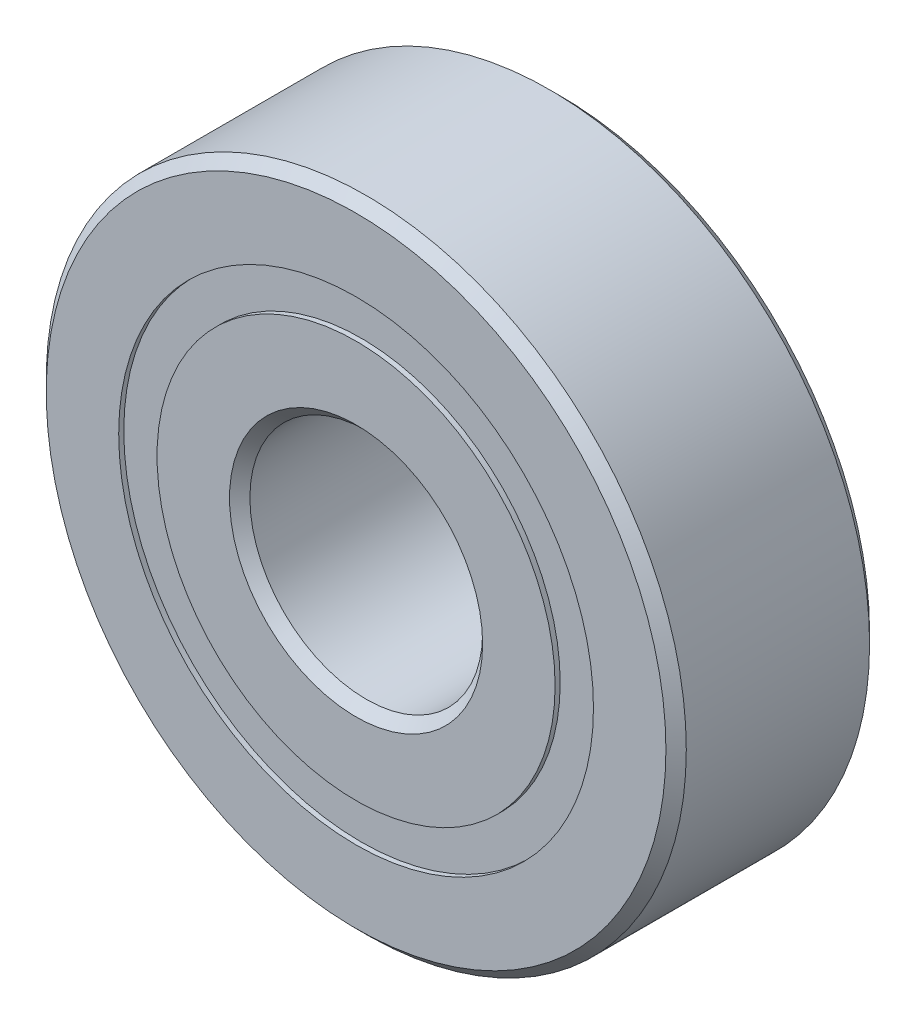
ISO-10303-21;
HEADER;
FILE_DESCRIPTION(('STEP AP214'),'2;1');
FILE_NAME('part.step','',(''),(''),'','','');
FILE_SCHEMA(('AUTOMOTIVE_DESIGN { 1 0 10303 214 1 1 1 1 }'));
ENDSEC;
DATA;
#1=APPLICATION_CONTEXT('core data for automotive mechanical design processes');
#2=APPLICATION_PROTOCOL_DEFINITION('international standard','automotive_design',2000,#1);
#3=PRODUCT_CONTEXT('',#1,'mechanical');
#4=PRODUCT('Part','Part','',(#3));
#5=PRODUCT_RELATED_PRODUCT_CATEGORY('part','',(#4));
#6=PRODUCT_DEFINITION_FORMATION('','',#4);
#7=PRODUCT_DEFINITION_CONTEXT('part definition',#1,'design');
#8=PRODUCT_DEFINITION('design','',#6,#7);
#9=PRODUCT_DEFINITION_SHAPE('','',#8);
#10=(LENGTH_UNIT() NAMED_UNIT(*) SI_UNIT(.MILLI.,.METRE.));
#11=(NAMED_UNIT(*) PLANE_ANGLE_UNIT() SI_UNIT($,.RADIAN.));
#12=(NAMED_UNIT(*) SI_UNIT($,.STERADIAN.) SOLID_ANGLE_UNIT());
#13=UNCERTAINTY_MEASURE_WITH_UNIT(LENGTH_MEASURE(1.E-05),#10,'distance_accuracy_value','');
#14=(GEOMETRIC_REPRESENTATION_CONTEXT(3) GLOBAL_UNCERTAINTY_ASSIGNED_CONTEXT((#13)) GLOBAL_UNIT_ASSIGNED_CONTEXT((#10,
#11,#12)) REPRESENTATION_CONTEXT('',''));
#15=CARTESIAN_POINT('',(0.,0.,0.));
#16=DIRECTION('',(0.,0.,1.));
#17=DIRECTION('',(1.,0.,0.));
#18=AXIS2_PLACEMENT_3D('',#15,#16,#17);
#19=CARTESIAN_POINT('',(-3.74999999999992,6.49519052838334,0.));
#20=DIRECTION('',(0.,0.,1.));
#21=DIRECTION('',(-0.499999999999989,0.866025403784445,0.));
#22=AXIS2_PLACEMENT_3D('',#19,#20,#21);
#23=SPHERICAL_SURFACE('',#22,1.68952158656808);
#24=CARTESIAN_POINT('',(-3.74999999999992,6.49519052838334,1.68952158656808));
#25=VERTEX_POINT('',#24);
#26=VERTEX_LOOP('',#25);
#27=FACE_BOUND('',#26,.T.);
#28=ADVANCED_FACE('F42',(#27),#23,.T.);
#29=CLOSED_SHELL('',(#28));
#30=MANIFOLD_SOLID_BREP('B2',#29);
#31=CARTESIAN_POINT('',(-6.49519052838325,3.75000000000008,0.));
#32=DIRECTION('',(0.,0.,1.));
#33=DIRECTION('',(-0.866025403784433,0.50000000000001,0.));
#34=AXIS2_PLACEMENT_3D('',#31,#32,#33);
#35=SPHERICAL_SURFACE('',#34,1.68952158656808);
#36=CARTESIAN_POINT('',(-6.49519052838325,3.75000000000008,1.68952158656808));
#37=VERTEX_POINT('',#36);
#38=VERTEX_LOOP('',#37);
#39=FACE_BOUND('',#38,.T.);
#40=ADVANCED_FACE('F65',(#39),#35,.T.);
#41=CLOSED_SHELL('',(#40));
#42=MANIFOLD_SOLID_BREP('B6',#41);
#43=CARTESIAN_POINT('',(-7.50000000000001,0.,0.));
#44=DIRECTION('',(0.,0.,1.));
#45=DIRECTION('',(-1.,0.,0.));
#46=AXIS2_PLACEMENT_3D('',#43,#44,#45);
#47=SPHERICAL_SURFACE('',#46,1.68952158656808);
#48=CARTESIAN_POINT('',(-7.50000000000001,0.,1.68952158656808));
#49=VERTEX_POINT('',#48);
#50=VERTEX_LOOP('',#49);
#51=FACE_BOUND('',#50,.T.);
#52=ADVANCED_FACE('F88',(#51),#47,.T.);
#53=CLOSED_SHELL('',(#52));
#54=MANIFOLD_SOLID_BREP('B38',#53);
#55=CARTESIAN_POINT('',(-6.49519052838333,-3.74999999999994,0.));
#56=DIRECTION('',(0.,0.,1.));
#57=DIRECTION('',(-0.866025403784443,-0.499999999999992,0.));
#58=AXIS2_PLACEMENT_3D('',#55,#56,#57);
#59=SPHERICAL_SURFACE('',#58,1.68952158656808);
#60=CARTESIAN_POINT('',(-6.49519052838333,-3.74999999999994,1.68952158656808));
#61=VERTEX_POINT('',#60);
#62=VERTEX_LOOP('',#61);
#63=FACE_BOUND('',#62,.T.);
#64=ADVANCED_FACE('F111',(#63),#59,.T.);
#65=CLOSED_SHELL('',(#64));
#66=MANIFOLD_SOLID_BREP('B61',#65);
#67=CARTESIAN_POINT('',(-3.75000000000006,-6.49519052838327,0.));
#68=DIRECTION('',(0.,0.,1.));
#69=DIRECTION('',(-0.500000000000007,-0.866025403784435,0.));
#70=AXIS2_PLACEMENT_3D('',#67,#68,#69);
#71=SPHERICAL_SURFACE('',#70,1.68952158656808);
#72=CARTESIAN_POINT('',(-3.75000000000006,-6.49519052838327,1.68952158656808));
#73=VERTEX_POINT('',#72);
#74=VERTEX_LOOP('',#73);
#75=FACE_BOUND('',#74,.T.);
#76=ADVANCED_FACE('F134',(#75),#71,.T.);
#77=CLOSED_SHELL('',(#76));
#78=MANIFOLD_SOLID_BREP('B84',#77);
#79=CARTESIAN_POINT('',(0.,-7.50000000000001,0.));
#80=DIRECTION('',(0.,0.,1.));
#81=DIRECTION('',(0.,-1.,0.));
#82=AXIS2_PLACEMENT_3D('',#79,#80,#81);
#83=SPHERICAL_SURFACE('',#82,1.68952158656808);
#84=CARTESIAN_POINT('',(0.,-7.50000000000001,1.68952158656808));
#85=VERTEX_POINT('',#84);
#86=VERTEX_LOOP('',#85);
#87=FACE_BOUND('',#86,.T.);
#88=ADVANCED_FACE('F157',(#87),#83,.T.);
#89=CLOSED_SHELL('',(#88));
#90=MANIFOLD_SOLID_BREP('B107',#89);
#91=CARTESIAN_POINT('',(3.74999999999997,-6.49519052838332,0.));
#92=DIRECTION('',(0.,0.,1.));
#93=DIRECTION('',(0.499999999999995,-0.866025403784442,0.));
#94=AXIS2_PLACEMENT_3D('',#91,#92,#93);
#95=SPHERICAL_SURFACE('',#94,1.68952158656808);
#96=CARTESIAN_POINT('',(3.74999999999997,-6.49519052838332,1.68952158656808));
#97=VERTEX_POINT('',#96);
#98=VERTEX_LOOP('',#97);
#99=FACE_BOUND('',#98,.T.);
#100=ADVANCED_FACE('F180',(#99),#95,.T.);
#101=CLOSED_SHELL('',(#100));
#102=MANIFOLD_SOLID_BREP('B130',#101);
#103=CARTESIAN_POINT('',(6.49519052838328,-3.75000000000003,0.));
#104=DIRECTION('',(0.,0.,1.));
#105=DIRECTION('',(0.866025403784436,-0.500000000000004,0.));
#106=AXIS2_PLACEMENT_3D('',#103,#104,#105);
#107=SPHERICAL_SURFACE('',#106,1.68952158656808);
#108=CARTESIAN_POINT('',(6.49519052838328,-3.75000000000003,1.68952158656808));
#109=VERTEX_POINT('',#108);
#110=VERTEX_LOOP('',#109);
#111=FACE_BOUND('',#110,.T.);
#112=ADVANCED_FACE('F203',(#111),#107,.T.);
#113=CLOSED_SHELL('',(#112));
#114=MANIFOLD_SOLID_BREP('B153',#113);
#115=CARTESIAN_POINT('',(7.50000000000001,0.,0.));
#116=DIRECTION('',(0.,0.,1.));
#117=DIRECTION('',(1.,0.,0.));
#118=AXIS2_PLACEMENT_3D('',#115,#116,#117);
#119=SPHERICAL_SURFACE('',#118,1.68952158656808);
#120=CARTESIAN_POINT('',(7.50000000000001,0.,1.68952158656808));
#121=VERTEX_POINT('',#120);
#122=VERTEX_LOOP('',#121);
#123=FACE_BOUND('',#122,.T.);
#124=ADVANCED_FACE('F226',(#123),#119,.T.);
#125=CLOSED_SHELL('',(#124));
#126=MANIFOLD_SOLID_BREP('B176',#125);
#127=CARTESIAN_POINT('',(6.4951905283833,3.74999999999999,0.));
#128=DIRECTION('',(0.,0.,1.));
#129=DIRECTION('',(0.86602540378444,0.499999999999998,0.));
#130=AXIS2_PLACEMENT_3D('',#127,#128,#129);
#131=SPHERICAL_SURFACE('',#130,1.68952158656808);
#132=CARTESIAN_POINT('',(6.4951905283833,3.74999999999999,1.68952158656808));
#133=VERTEX_POINT('',#132);
#134=VERTEX_LOOP('',#133);
#135=FACE_BOUND('',#134,.T.);
#136=ADVANCED_FACE('F249',(#135),#131,.T.);
#137=CLOSED_SHELL('',(#136));
#138=MANIFOLD_SOLID_BREP('B199',#137);
#139=CARTESIAN_POINT('',(3.75000000000001,6.49519052838329,0.));
#140=DIRECTION('',(0.,0.,1.));
#141=DIRECTION('',(0.500000000000001,0.866025403784438,0.));
#142=AXIS2_PLACEMENT_3D('',#139,#140,#141);
#143=SPHERICAL_SURFACE('',#142,1.68952158656808);
#144=CARTESIAN_POINT('',(3.75000000000001,6.49519052838329,1.68952158656808));
#145=VERTEX_POINT('',#144);
#146=VERTEX_LOOP('',#145);
#147=FACE_BOUND('',#146,.T.);
#148=ADVANCED_FACE('F272',(#147),#143,.T.);
#149=CLOSED_SHELL('',(#148));
#150=MANIFOLD_SOLID_BREP('B222',#149);
#151=CARTESIAN_POINT('',(0.,7.50000000000001,0.));
#152=DIRECTION('',(0.,0.,1.));
#153=DIRECTION('',(0.,1.,0.));
#154=AXIS2_PLACEMENT_3D('',#151,#152,#153);
#155=SPHERICAL_SURFACE('',#154,1.68952158656808);
#156=CARTESIAN_POINT('',(0.,7.50000000000001,1.68952158656808));
#157=VERTEX_POINT('',#156);
#158=VERTEX_LOOP('',#157);
#159=FACE_BOUND('',#158,.T.);
#160=ADVANCED_FACE('F296',(#159),#155,.T.);
#161=CLOSED_SHELL('',(#160));
#162=MANIFOLD_SOLID_BREP('B245',#161);
#163=CARTESIAN_POINT('',(0.,0.,3.5));
#164=DIRECTION('',(0.,0.,1.));
#165=DIRECTION('',(1.,0.,0.));
#166=AXIS2_PLACEMENT_3D('',#163,#164,#165);
#167=CYLINDRICAL_SURFACE('',#166,8.15934065934067);
#168=CARTESIAN_POINT('',(0.,0.,-3.5));
#169=DIRECTION('',(0.,0.,1.));
#170=DIRECTION('',(1.,0.,0.));
#171=AXIS2_PLACEMENT_3D('',#168,#169,#170);
#172=CIRCLE('',#171,8.15934065934067);
#173=CARTESIAN_POINT('',(8.15934065934067,0.,-3.5));
#174=VERTEX_POINT('',#173);
#175=EDGE_CURVE('E351',#174,#174,#172,.T.);
#176=ORIENTED_EDGE('',*,*,#175,.F.);
#177=EDGE_LOOP('',(#176));
#178=FACE_BOUND('',#177,.T.);
#179=CARTESIAN_POINT('',(0.,0.,-3.325));
#180=DIRECTION('',(0.,0.,1.));
#181=DIRECTION('',(1.,0.,0.));
#182=AXIS2_PLACEMENT_3D('',#179,#180,#181);
#183=CIRCLE('',#182,8.15934065934067);
#184=CARTESIAN_POINT('',(8.15934065934067,0.,-3.325));
#185=VERTEX_POINT('',#184);
#186=EDGE_CURVE('E295',#185,#185,#183,.F.);
#187=ORIENTED_EDGE('',*,*,#186,.F.);
#188=EDGE_LOOP('',(#187));
#189=FACE_BOUND('',#188,.T.);
#190=ADVANCED_FACE('F312',(#178,#189),#167,.F.);
#191=CARTESIAN_POINT('',(0.,0.,3.5));
#192=DIRECTION('',(0.,0.,1.));
#193=DIRECTION('',(1.,0.,0.));
#194=AXIS2_PLACEMENT_3D('',#191,#192,#193);
#195=CYLINDRICAL_SURFACE('',#194,6.84065934065935);
#196=CARTESIAN_POINT('',(0.,0.,-3.5));
#197=DIRECTION('',(0.,0.,1.));
#198=DIRECTION('',(1.,0.,0.));
#199=AXIS2_PLACEMENT_3D('',#196,#197,#198);
#200=CIRCLE('',#199,6.84065934065935);
#201=CARTESIAN_POINT('',(6.84065934065935,0.,-3.5));
#202=VERTEX_POINT('',#201);
#203=EDGE_CURVE('E378',#202,#202,#200,.T.);
#204=ORIENTED_EDGE('',*,*,#203,.T.);
#205=EDGE_LOOP('',(#204));
#206=FACE_BOUND('',#205,.T.);
#207=CARTESIAN_POINT('',(0.,0.,-3.325));
#208=DIRECTION('',(0.,0.,1.));
#209=DIRECTION('',(1.,0.,0.));
#210=AXIS2_PLACEMENT_3D('',#207,#208,#209);
#211=CIRCLE('',#210,6.84065934065935);
#212=CARTESIAN_POINT('',(6.84065934065935,0.,-3.325));
#213=VERTEX_POINT('',#212);
#214=EDGE_CURVE('E324',#213,#213,#211,.T.);
#215=ORIENTED_EDGE('',*,*,#214,.F.);
#216=EDGE_LOOP('',(#215));
#217=FACE_BOUND('',#216,.T.);
#218=ADVANCED_FACE('F420',(#206,#217),#195,.T.);
#219=CARTESIAN_POINT('',(0.,0.,3.5));
#220=DIRECTION('',(0.,0.,1.));
#221=DIRECTION('',(1.,0.,0.));
#222=AXIS2_PLACEMENT_3D('',#219,#220,#221);
#223=CYLINDRICAL_SURFACE('',#222,8.15934065934067);
#224=CARTESIAN_POINT('',(0.,0.,3.5));
#225=DIRECTION('',(0.,0.,1.));
#226=DIRECTION('',(1.,0.,0.));
#227=AXIS2_PLACEMENT_3D('',#224,#225,#226);
#228=CIRCLE('',#227,8.15934065934067);
#229=CARTESIAN_POINT('',(8.15934065934067,0.,3.5));
#230=VERTEX_POINT('',#229);
#231=EDGE_CURVE('E342',#230,#230,#228,.T.);
#232=ORIENTED_EDGE('',*,*,#231,.T.);
#233=EDGE_LOOP('',(#232));
#234=FACE_BOUND('',#233,.T.);
#235=CARTESIAN_POINT('',(0.,0.,3.325));
#236=DIRECTION('',(0.,0.,-1.));
#237=DIRECTION('',(-1.,0.,0.));
#238=AXIS2_PLACEMENT_3D('',#235,#236,#237);
#239=CIRCLE('',#238,8.15934065934067);
#240=CARTESIAN_POINT('',(-8.15934065934067,0.,3.325));
#241=VERTEX_POINT('',#240);
#242=EDGE_CURVE('E333',#241,#241,#239,.F.);
#243=ORIENTED_EDGE('',*,*,#242,.F.);
#244=EDGE_LOOP('',(#243));
#245=FACE_BOUND('',#244,.T.);
#246=ADVANCED_FACE('F418',(#234,#245),#223,.F.);
#247=CARTESIAN_POINT('',(0.,0.,3.15));
#248=DIRECTION('',(0.,0.,-1.));
#249=DIRECTION('',(-1.,0.,0.));
#250=AXIS2_PLACEMENT_3D('',#247,#248,#249);
#251=CONICAL_SURFACE('',#250,11.,0.78539816339745);
#252=CARTESIAN_POINT('',(0.,0.,3.5));
#253=DIRECTION('',(0.,0.,1.));
#254=DIRECTION('',(1.,0.,0.));
#255=AXIS2_PLACEMENT_3D('',#252,#253,#254);
#256=CIRCLE('',#255,10.65);
#257=CARTESIAN_POINT('',(10.65,0.,3.5));
#258=VERTEX_POINT('',#257);
#259=EDGE_CURVE('E339',#258,#258,#256,.T.);
#260=ORIENTED_EDGE('',*,*,#259,.F.);
#261=EDGE_LOOP('',(#260));
#262=FACE_BOUND('',#261,.T.);
#263=CARTESIAN_POINT('',(0.,0.,3.15));
#264=DIRECTION('',(0.,0.,1.));
#265=DIRECTION('',(1.,0.,0.));
#266=AXIS2_PLACEMENT_3D('',#263,#264,#265);
#267=CIRCLE('',#266,11.);
#268=CARTESIAN_POINT('',(11.,0.,3.15));
#269=VERTEX_POINT('',#268);
#270=EDGE_CURVE('E360',#269,#269,#267,.T.);
#271=ORIENTED_EDGE('',*,*,#270,.T.);
#272=EDGE_LOOP('',(#271));
#273=FACE_BOUND('',#272,.T.);
#274=ADVANCED_FACE('F314',(#262,#273),#251,.T.);
#275=CARTESIAN_POINT('',(0.,10.65,3.5));
#276=DIRECTION('',(0.,0.,-1.));
#277=DIRECTION('',(-1.,0.,0.));
#278=AXIS2_PLACEMENT_3D('',#275,#276,#277);
#279=PLANE('',#278);
#280=ORIENTED_EDGE('',*,*,#231,.F.);
#281=EDGE_LOOP('',(#280));
#282=FACE_BOUND('',#281,.T.);
#283=ORIENTED_EDGE('',*,*,#259,.T.);
#284=EDGE_LOOP('',(#283));
#285=FACE_BOUND('',#284,.T.);
#286=ADVANCED_FACE('F428',(#282,#285),#279,.F.);
#287=CARTESIAN_POINT('',(0.,10.65,-3.5));
#288=DIRECTION('',(0.,0.,1.));
#289=DIRECTION('',(1.,0.,0.));
#290=AXIS2_PLACEMENT_3D('',#287,#288,#289);
#291=PLANE('',#290);
#292=CARTESIAN_POINT('',(0.,0.,-3.5));
#293=DIRECTION('',(0.,0.,1.));
#294=DIRECTION('',(1.,0.,0.));
#295=AXIS2_PLACEMENT_3D('',#292,#293,#294);
#296=CIRCLE('',#295,10.65);
#297=CARTESIAN_POINT('',(10.65,0.,-3.5));
#298=VERTEX_POINT('',#297);
#299=EDGE_CURVE('E354',#298,#298,#296,.T.);
#300=ORIENTED_EDGE('',*,*,#299,.F.);
#301=EDGE_LOOP('',(#300));
#302=FACE_BOUND('',#301,.T.);
#303=ORIENTED_EDGE('',*,*,#175,.T.);
#304=EDGE_LOOP('',(#303));
#305=FACE_BOUND('',#304,.T.);
#306=ADVANCED_FACE('F490',(#302,#305),#291,.F.);
#307=CARTESIAN_POINT('',(0.,0.,-3.5));
#308=DIRECTION('',(0.,0.,1.));
#309=DIRECTION('',(1.,0.,0.));
#310=AXIS2_PLACEMENT_3D('',#307,#308,#309);
#311=CONICAL_SURFACE('',#310,10.65,0.785398163397459);
#312=CARTESIAN_POINT('',(0.,0.,-3.15));
#313=DIRECTION('',(0.,0.,1.));
#314=DIRECTION('',(1.,0.,0.));
#315=AXIS2_PLACEMENT_3D('',#312,#313,#314);
#316=CIRCLE('',#315,11.);
#317=CARTESIAN_POINT('',(11.,0.,-3.15));
#318=VERTEX_POINT('',#317);
#319=EDGE_CURVE('E357',#318,#318,#316,.T.);
#320=ORIENTED_EDGE('',*,*,#319,.F.);
#321=EDGE_LOOP('',(#320));
#322=FACE_BOUND('',#321,.T.);
#323=ORIENTED_EDGE('',*,*,#299,.T.);
#324=EDGE_LOOP('',(#323));
#325=FACE_BOUND('',#324,.T.);
#326=ADVANCED_FACE('F487',(#322,#325),#311,.T.);
#327=CARTESIAN_POINT('',(0.,0.,3.5));
#328=DIRECTION('',(0.,0.,1.));
#329=DIRECTION('',(1.,0.,0.));
#330=AXIS2_PLACEMENT_3D('',#327,#328,#329);
#331=CYLINDRICAL_SURFACE('',#330,11.);
#332=ORIENTED_EDGE('',*,*,#270,.F.);
#333=EDGE_LOOP('',(#332));
#334=FACE_BOUND('',#333,.T.);
#335=ORIENTED_EDGE('',*,*,#319,.T.);
#336=EDGE_LOOP('',(#335));
#337=FACE_BOUND('',#336,.T.);
#338=ADVANCED_FACE('F414',(#334,#337),#331,.T.);
#339=CARTESIAN_POINT('',(0.,8.15934065934067,3.325));
#340=DIRECTION('',(0.,0.,-1.));
#341=DIRECTION('',(-1.,0.,0.));
#342=AXIS2_PLACEMENT_3D('',#339,#340,#341);
#343=PLANE('',#342);
#344=CARTESIAN_POINT('',(0.,0.,3.325));
#345=DIRECTION('',(0.,0.,1.));
#346=DIRECTION('',(1.,0.,0.));
#347=AXIS2_PLACEMENT_3D('',#344,#345,#346);
#348=CIRCLE('',#347,6.84065934065935);
#349=CARTESIAN_POINT('',(6.84065934065935,0.,3.325));
#350=VERTEX_POINT('',#349);
#351=EDGE_CURVE('E363',#350,#350,#348,.T.);
#352=ORIENTED_EDGE('',*,*,#351,.F.);
#353=EDGE_LOOP('',(#352));
#354=FACE_BOUND('',#353,.T.);
#355=ORIENTED_EDGE('',*,*,#242,.T.);
#356=EDGE_LOOP('',(#355));
#357=FACE_BOUND('',#356,.T.);
#358=ADVANCED_FACE('F407',(#354,#357),#343,.F.);
#359=CARTESIAN_POINT('',(0.,0.,3.5));
#360=DIRECTION('',(0.,0.,1.));
#361=DIRECTION('',(1.,0.,0.));
#362=AXIS2_PLACEMENT_3D('',#359,#360,#361);
#363=CYLINDRICAL_SURFACE('',#362,6.84065934065935);
#364=CARTESIAN_POINT('',(0.,0.,3.5));
#365=DIRECTION('',(0.,0.,1.));
#366=DIRECTION('',(1.,0.,0.));
#367=AXIS2_PLACEMENT_3D('',#364,#365,#366);
#368=CIRCLE('',#367,6.84065934065935);
#369=CARTESIAN_POINT('',(6.84065934065935,0.,3.5));
#370=VERTEX_POINT('',#369);
#371=EDGE_CURVE('E387',#370,#370,#368,.T.);
#372=ORIENTED_EDGE('',*,*,#371,.F.);
#373=EDGE_LOOP('',(#372));
#374=FACE_BOUND('',#373,.T.);
#375=ORIENTED_EDGE('',*,*,#351,.T.);
#376=EDGE_LOOP('',(#375));
#377=FACE_BOUND('',#376,.T.);
#378=ADVANCED_FACE('F404',(#374,#377),#363,.T.);
#379=CARTESIAN_POINT('',(0.,0.,3.5));
#380=DIRECTION('',(0.,0.,1.));
#381=DIRECTION('',(1.,0.,0.));
#382=AXIS2_PLACEMENT_3D('',#379,#380,#381);
#383=CONICAL_SURFACE('',#382,4.35000000000002,0.785398163397462);
#384=CARTESIAN_POINT('',(0.,0.,3.15));
#385=DIRECTION('',(0.,0.,1.));
#386=DIRECTION('',(1.,0.,0.));
#387=AXIS2_PLACEMENT_3D('',#384,#385,#386);
#388=CIRCLE('',#387,4.00000000000001);
#389=CARTESIAN_POINT('',(4.00000000000001,0.,3.15));
#390=VERTEX_POINT('',#389);
#391=EDGE_CURVE('E369',#390,#390,#388,.T.);
#392=ORIENTED_EDGE('',*,*,#391,.F.);
#393=EDGE_LOOP('',(#392));
#394=FACE_BOUND('',#393,.T.);
#395=CARTESIAN_POINT('',(0.,0.,3.5));
#396=DIRECTION('',(0.,0.,1.));
#397=DIRECTION('',(1.,0.,0.));
#398=AXIS2_PLACEMENT_3D('',#395,#396,#397);
#399=CIRCLE('',#398,4.35000000000002);
#400=CARTESIAN_POINT('',(4.35000000000002,0.,3.5));
#401=VERTEX_POINT('',#400);
#402=EDGE_CURVE('E390',#401,#401,#399,.T.);
#403=ORIENTED_EDGE('',*,*,#402,.T.);
#404=EDGE_LOOP('',(#403));
#405=FACE_BOUND('',#404,.T.);
#406=ADVANCED_FACE('F394',(#394,#405),#383,.F.);
#407=CARTESIAN_POINT('',(0.,0.,3.5));
#408=DIRECTION('',(0.,0.,1.));
#409=DIRECTION('',(1.,0.,0.));
#410=AXIS2_PLACEMENT_3D('',#407,#408,#409);
#411=CYLINDRICAL_SURFACE('',#410,4.00000000000001);
#412=CARTESIAN_POINT('',(0.,0.,-3.15));
#413=DIRECTION('',(0.,0.,1.));
#414=DIRECTION('',(1.,0.,0.));
#415=AXIS2_PLACEMENT_3D('',#412,#413,#414);
#416=CIRCLE('',#415,4.00000000000001);
#417=CARTESIAN_POINT('',(4.00000000000001,0.,-3.15));
#418=VERTEX_POINT('',#417);
#419=EDGE_CURVE('E372',#418,#418,#416,.T.);
#420=ORIENTED_EDGE('',*,*,#419,.F.);
#421=EDGE_LOOP('',(#420));
#422=FACE_BOUND('',#421,.T.);
#423=ORIENTED_EDGE('',*,*,#391,.T.);
#424=EDGE_LOOP('',(#423));
#425=FACE_BOUND('',#424,.T.);
#426=ADVANCED_FACE('F477',(#422,#425),#411,.F.);
#427=CARTESIAN_POINT('',(0.,0.,-3.15));
#428=DIRECTION('',(0.,0.,-1.));
#429=DIRECTION('',(-1.,0.,0.));
#430=AXIS2_PLACEMENT_3D('',#427,#428,#429);
#431=CONICAL_SURFACE('',#430,4.00000000000001,0.785398163397462);
#432=CARTESIAN_POINT('',(0.,0.,-3.5));
#433=DIRECTION('',(0.,0.,1.));
#434=DIRECTION('',(1.,0.,0.));
#435=AXIS2_PLACEMENT_3D('',#432,#433,#434);
#436=CIRCLE('',#435,4.35000000000002);
#437=CARTESIAN_POINT('',(4.35000000000002,0.,-3.5));
#438=VERTEX_POINT('',#437);
#439=EDGE_CURVE('E375',#438,#438,#436,.T.);
#440=ORIENTED_EDGE('',*,*,#439,.F.);
#441=EDGE_LOOP('',(#440));
#442=FACE_BOUND('',#441,.T.);
#443=ORIENTED_EDGE('',*,*,#419,.T.);
#444=EDGE_LOOP('',(#443));
#445=FACE_BOUND('',#444,.T.);
#446=ADVANCED_FACE('F473',(#442,#445),#431,.F.);
#447=CARTESIAN_POINT('',(0.,4.35000000000002,-3.5));
#448=DIRECTION('',(0.,0.,1.));
#449=DIRECTION('',(1.,0.,0.));
#450=AXIS2_PLACEMENT_3D('',#447,#448,#449);
#451=PLANE('',#450);
#452=ORIENTED_EDGE('',*,*,#203,.F.);
#453=EDGE_LOOP('',(#452));
#454=FACE_BOUND('',#453,.T.);
#455=ORIENTED_EDGE('',*,*,#439,.T.);
#456=EDGE_LOOP('',(#455));
#457=FACE_BOUND('',#456,.T.);
#458=ADVANCED_FACE('F400',(#454,#457),#451,.F.);
#459=CARTESIAN_POINT('',(0.,4.35000000000002,3.5));
#460=DIRECTION('',(0.,0.,-1.));
#461=DIRECTION('',(-1.,0.,0.));
#462=AXIS2_PLACEMENT_3D('',#459,#460,#461);
#463=PLANE('',#462);
#464=ORIENTED_EDGE('',*,*,#402,.F.);
#465=EDGE_LOOP('',(#464));
#466=FACE_BOUND('',#465,.T.);
#467=ORIENTED_EDGE('',*,*,#371,.T.);
#468=EDGE_LOOP('',(#467));
#469=FACE_BOUND('',#468,.T.);
#470=ADVANCED_FACE('F396',(#466,#469),#463,.F.);
#471=CARTESIAN_POINT('',(0.,8.15934065934067,-3.325));
#472=DIRECTION('',(0.,0.,1.));
#473=DIRECTION('',(1.,0.,0.));
#474=AXIS2_PLACEMENT_3D('',#471,#472,#473);
#475=PLANE('',#474);
#476=ORIENTED_EDGE('',*,*,#186,.T.);
#477=EDGE_LOOP('',(#476));
#478=FACE_BOUND('',#477,.T.);
#479=ORIENTED_EDGE('',*,*,#214,.T.);
#480=EDGE_LOOP('',(#479));
#481=FACE_BOUND('',#480,.T.);
#482=ADVANCED_FACE('F399',(#478,#481),#475,.F.);
#483=CLOSED_SHELL('',(#190,#218,#246,#274,#286,#306,#326,#338,#358,#378,#406,#426,#446,#458,
#470,#482));
#484=CARTESIAN_POINT('',(0.,8.15934065934067,-1.68952158656808));
#485=DIRECTION('',(0.,0.,-1.));
#486=DIRECTION('',(-1.,0.,0.));
#487=AXIS2_PLACEMENT_3D('',#484,#485,#486);
#488=PLANE('',#487);
#489=CARTESIAN_POINT('',(0.,0.,-1.68952158656808));
#490=DIRECTION('',(0.,0.,-1.));
#491=DIRECTION('',(-1.,0.,0.));
#492=AXIS2_PLACEMENT_3D('',#489,#490,#491);
#493=CIRCLE('',#492,6.84065934065935);
#494=CARTESIAN_POINT('',(-6.84065934065935,0.,-1.68952158656808));
#495=VERTEX_POINT('',#494);
#496=EDGE_CURVE('E328',#495,#495,#493,.T.);
#497=ORIENTED_EDGE('',*,*,#496,.T.);
#498=EDGE_LOOP('',(#497));
#499=FACE_BOUND('',#498,.T.);
#500=CARTESIAN_POINT('',(0.,0.,-1.68952158656808));
#501=DIRECTION('',(0.,0.,-1.));
#502=DIRECTION('',(-1.,0.,0.));
#503=AXIS2_PLACEMENT_3D('',#500,#501,#502);
#504=CIRCLE('',#503,8.15934065934067);
#505=CARTESIAN_POINT('',(-8.15934065934067,0.,-1.68952158656808));
#506=VERTEX_POINT('',#505);
#507=EDGE_CURVE('E320',#506,#506,#504,.F.);
#508=ORIENTED_EDGE('',*,*,#507,.T.);
#509=EDGE_LOOP('',(#508));
#510=FACE_BOUND('',#509,.T.);
#511=ADVANCED_FACE('F436',(#499,#510),#488,.F.);
#512=CARTESIAN_POINT('',(0.,0.,1.55555555555556));
#513=DIRECTION('',(0.,0.,1.));
#514=DIRECTION('',(1.,0.,0.));
#515=AXIS2_PLACEMENT_3D('',#512,#513,#514);
#516=CIRCLE('',#515,8.15934065934067);
#517=CARTESIAN_POINT('',(8.15934065934067,0.,1.55555555555556));
#518=VERTEX_POINT('',#517);
#519=EDGE_CURVE('E345',#518,#518,#516,.T.);
#520=ORIENTED_EDGE('',*,*,#519,.F.);
#521=EDGE_LOOP('',(#520));
#522=FACE_BOUND('',#521,.T.);
#523=CARTESIAN_POINT('',(0.,0.,1.68952158656808));
#524=DIRECTION('',(0.,0.,1.));
#525=DIRECTION('',(1.,0.,0.));
#526=AXIS2_PLACEMENT_3D('',#523,#524,#525);
#527=CIRCLE('',#526,8.15934065934067);
#528=CARTESIAN_POINT('',(8.15934065934067,0.,1.68952158656808));
#529=VERTEX_POINT('',#528);
#530=EDGE_CURVE('E336',#529,#529,#527,.F.);
#531=ORIENTED_EDGE('',*,*,#530,.F.);
#532=EDGE_LOOP('',(#531));
#533=FACE_BOUND('',#532,.T.);
#534=ADVANCED_FACE('F423',(#522,#533),#223,.F.);
#535=CARTESIAN_POINT('',(0.,0.,0.));
#536=DIRECTION('',(0.,0.,1.));
#537=DIRECTION('',(1.,0.,0.));
#538=AXIS2_PLACEMENT_3D('',#535,#536,#537);
#539=TOROIDAL_SURFACE('',#538,7.50000000000001,1.68952158656808);
#540=CARTESIAN_POINT('',(0.,0.,-1.55555555555556));
#541=DIRECTION('',(0.,0.,1.));
#542=DIRECTION('',(1.,0.,0.));
#543=AXIS2_PLACEMENT_3D('',#540,#541,#542);
#544=CIRCLE('',#543,8.15934065934067);
#545=CARTESIAN_POINT('',(8.15934065934067,0.,-1.55555555555556));
#546=VERTEX_POINT('',#545);
#547=EDGE_CURVE('E348',#546,#546,#544,.T.);
#548=ORIENTED_EDGE('',*,*,#547,.F.);
#549=EDGE_LOOP('',(#548));
#550=FACE_BOUND('',#549,.T.);
#551=ORIENTED_EDGE('',*,*,#519,.T.);
#552=EDGE_LOOP('',(#551));
#553=FACE_BOUND('',#552,.T.);
#554=ADVANCED_FACE('F435',(#550,#553),#539,.F.);
#555=ORIENTED_EDGE('',*,*,#547,.T.);
#556=EDGE_LOOP('',(#555));
#557=FACE_BOUND('',#556,.T.);
#558=ORIENTED_EDGE('',*,*,#507,.F.);
#559=EDGE_LOOP('',(#558));
#560=FACE_BOUND('',#559,.T.);
#561=ADVANCED_FACE('F442',(#557,#560),#167,.F.);
#562=CARTESIAN_POINT('',(0.,8.15934065934067,1.68952158656808));
#563=DIRECTION('',(0.,0.,1.));
#564=DIRECTION('',(1.,0.,0.));
#565=AXIS2_PLACEMENT_3D('',#562,#563,#564);
#566=PLANE('',#565);
#567=ORIENTED_EDGE('',*,*,#530,.T.);
#568=EDGE_LOOP('',(#567));
#569=FACE_BOUND('',#568,.T.);
#570=CARTESIAN_POINT('',(0.,0.,1.68952158656808));
#571=DIRECTION('',(0.,0.,1.));
#572=DIRECTION('',(1.,0.,0.));
#573=AXIS2_PLACEMENT_3D('',#570,#571,#572);
#574=CIRCLE('',#573,6.84065934065935);
#575=CARTESIAN_POINT('',(6.84065934065935,0.,1.68952158656808));
#576=VERTEX_POINT('',#575);
#577=EDGE_CURVE('E366',#576,#576,#574,.F.);
#578=ORIENTED_EDGE('',*,*,#577,.F.);
#579=EDGE_LOOP('',(#578));
#580=FACE_BOUND('',#579,.T.);
#581=ADVANCED_FACE('F449',(#569,#580),#566,.F.);
#582=CARTESIAN_POINT('',(0.,0.,1.55555555555556));
#583=DIRECTION('',(0.,0.,1.));
#584=DIRECTION('',(1.,0.,0.));
#585=AXIS2_PLACEMENT_3D('',#582,#583,#584);
#586=CIRCLE('',#585,6.84065934065935);
#587=CARTESIAN_POINT('',(6.84065934065935,0.,1.55555555555556));
#588=VERTEX_POINT('',#587);
#589=EDGE_CURVE('E384',#588,#588,#586,.T.);
#590=ORIENTED_EDGE('',*,*,#589,.T.);
#591=EDGE_LOOP('',(#590));
#592=FACE_BOUND('',#591,.T.);
#593=ORIENTED_EDGE('',*,*,#577,.T.);
#594=EDGE_LOOP('',(#593));
#595=FACE_BOUND('',#594,.T.);
#596=ADVANCED_FACE('F409',(#592,#595),#363,.T.);
#597=CARTESIAN_POINT('',(0.,0.,0.));
#598=DIRECTION('',(0.,0.,1.));
#599=DIRECTION('',(1.,0.,0.));
#600=AXIS2_PLACEMENT_3D('',#597,#598,#599);
#601=TOROIDAL_SURFACE('',#600,7.50000000000001,1.68952158656808);
#602=ORIENTED_EDGE('',*,*,#589,.F.);
#603=EDGE_LOOP('',(#602));
#604=FACE_BOUND('',#603,.T.);
#605=CARTESIAN_POINT('',(0.,0.,-1.55555555555556));
#606=DIRECTION('',(0.,0.,1.));
#607=DIRECTION('',(1.,0.,0.));
#608=AXIS2_PLACEMENT_3D('',#605,#606,#607);
#609=CIRCLE('',#608,6.84065934065935);
#610=CARTESIAN_POINT('',(6.84065934065935,0.,-1.55555555555556));
#611=VERTEX_POINT('',#610);
#612=EDGE_CURVE('E381',#611,#611,#609,.T.);
#613=ORIENTED_EDGE('',*,*,#612,.T.);
#614=EDGE_LOOP('',(#613));
#615=FACE_BOUND('',#614,.T.);
#616=ADVANCED_FACE('F467',(#604,#615),#601,.F.);
#617=ORIENTED_EDGE('',*,*,#612,.F.);
#618=EDGE_LOOP('',(#617));
#619=FACE_BOUND('',#618,.T.);
#620=ORIENTED_EDGE('',*,*,#496,.F.);
#621=EDGE_LOOP('',(#620));
#622=FACE_BOUND('',#621,.T.);
#623=ADVANCED_FACE('F432',(#619,#622),#195,.T.);
#624=CLOSED_SHELL('',(#511,#534,#554,#561,#581,#596,#616,#623));
#625=ORIENTED_CLOSED_SHELL('',*,#624,.T.);
#626=BREP_WITH_VOIDS('B268',#483,(#625));
#627=ADVANCED_BREP_SHAPE_REPRESENTATION('',(#18,#30,#42,#54,#66,#78,#90,#102,#114,#126,#138,
#150,#162,#626),#14);
#628=SHAPE_DEFINITION_REPRESENTATION(#9,#627);
ENDSEC;
END-ISO-10303-21;
